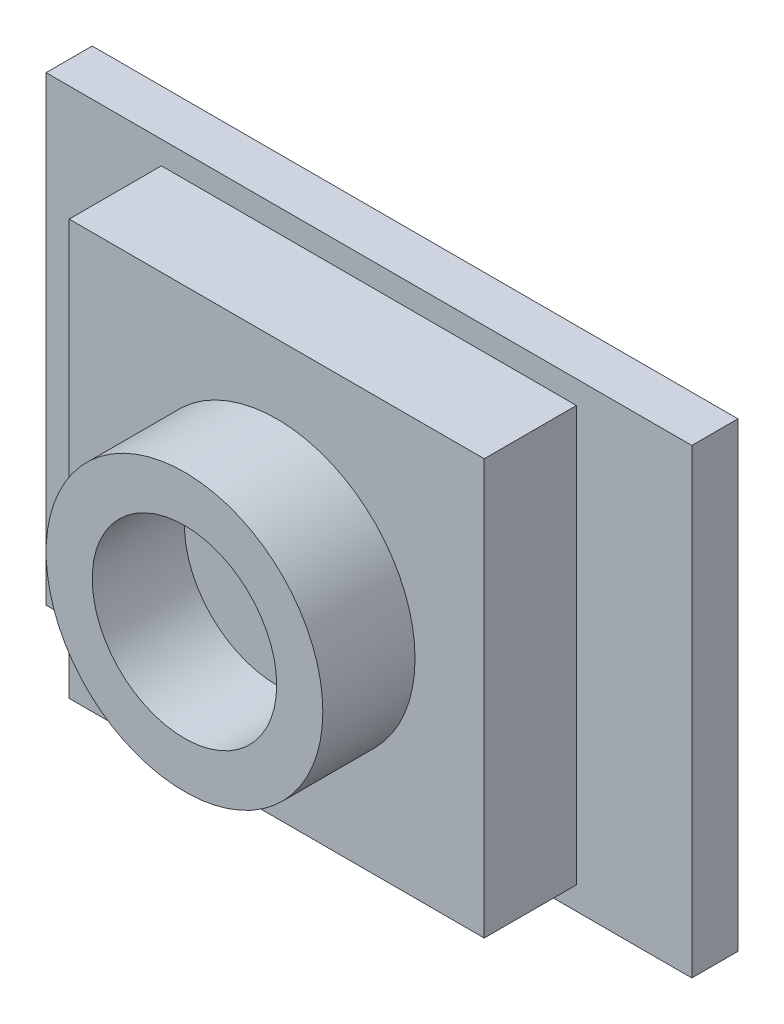
ISO-10303-21;
HEADER;
FILE_DESCRIPTION(('STEP AP214'),'2;1');
FILE_NAME('part.step','',(''),(''),'','','');
FILE_SCHEMA(('AUTOMOTIVE_DESIGN { 1 0 10303 214 1 1 1 1 }'));
ENDSEC;
DATA;
#1=APPLICATION_CONTEXT('core data for automotive mechanical design processes');
#2=APPLICATION_PROTOCOL_DEFINITION('international standard','automotive_design',2000,#1);
#3=PRODUCT_CONTEXT('',#1,'mechanical');
#4=PRODUCT('Part','Part','',(#3));
#5=PRODUCT_RELATED_PRODUCT_CATEGORY('part','',(#4));
#6=PRODUCT_DEFINITION_FORMATION('','',#4);
#7=PRODUCT_DEFINITION_CONTEXT('part definition',#1,'design');
#8=PRODUCT_DEFINITION('design','',#6,#7);
#9=PRODUCT_DEFINITION_SHAPE('','',#8);
#10=(LENGTH_UNIT() NAMED_UNIT(*) SI_UNIT(.MILLI.,.METRE.));
#11=(NAMED_UNIT(*) PLANE_ANGLE_UNIT() SI_UNIT($,.RADIAN.));
#12=(NAMED_UNIT(*) SI_UNIT($,.STERADIAN.) SOLID_ANGLE_UNIT());
#13=UNCERTAINTY_MEASURE_WITH_UNIT(LENGTH_MEASURE(1.E-05),#10,'distance_accuracy_value','');
#14=(GEOMETRIC_REPRESENTATION_CONTEXT(3) GLOBAL_UNCERTAINTY_ASSIGNED_CONTEXT((#13)) GLOBAL_UNIT_ASSIGNED_CONTEXT((#10,
#11,#12)) REPRESENTATION_CONTEXT('',''));
#15=CARTESIAN_POINT('',(0.,0.,0.));
#16=DIRECTION('',(0.,0.,1.));
#17=DIRECTION('',(1.,0.,0.));
#18=AXIS2_PLACEMENT_3D('',#15,#16,#17);
#19=CARTESIAN_POINT('',(0.,0.,0.));
#20=DIRECTION('',(0.,0.,1.));
#21=DIRECTION('',(1.,0.,0.));
#22=AXIS2_PLACEMENT_3D('',#19,#20,#21);
#23=PLANE('',#22);
#24=DIRECTION('',(1.,0.,0.));
#25=VECTOR('',#24,1.);
#26=CARTESIAN_POINT('',(-44.45,-31.75,0.));
#27=LINE('',#26,#25);
#28=CARTESIAN_POINT('',(-44.45,-31.75,0.));
#29=VERTEX_POINT('',#28);
#30=CARTESIAN_POINT('',(44.45,-31.75,0.));
#31=VERTEX_POINT('',#30);
#32=EDGE_CURVE('E131',#29,#31,#27,.T.);
#33=ORIENTED_EDGE('',*,*,#32,.T.);
#34=DIRECTION('',(0.,1.,0.));
#35=VECTOR('',#34,1.);
#36=CARTESIAN_POINT('',(44.45,-31.75,0.));
#37=LINE('',#36,#35);
#38=CARTESIAN_POINT('',(44.45,31.75,0.));
#39=VERTEX_POINT('',#38);
#40=EDGE_CURVE('E134',#31,#39,#37,.T.);
#41=ORIENTED_EDGE('',*,*,#40,.T.);
#42=DIRECTION('',(-1.,0.,0.));
#43=VECTOR('',#42,1.);
#44=CARTESIAN_POINT('',(-44.45,31.75,0.));
#45=LINE('',#44,#43);
#46=CARTESIAN_POINT('',(-44.45,31.75,0.));
#47=VERTEX_POINT('',#46);
#48=EDGE_CURVE('E151',#39,#47,#45,.T.);
#49=ORIENTED_EDGE('',*,*,#48,.T.);
#50=DIRECTION('',(0.,-1.,0.));
#51=VECTOR('',#50,1.);
#52=CARTESIAN_POINT('',(-44.45,-31.75,0.));
#53=LINE('',#52,#51);
#54=EDGE_CURVE('E142',#47,#29,#53,.T.);
#55=ORIENTED_EDGE('',*,*,#54,.T.);
#56=EDGE_LOOP('',(#33,#41,#49,#55));
#57=FACE_BOUND('',#56,.T.);
#58=DIRECTION('',(0.,1.,0.));
#59=VECTOR('',#58,1.);
#60=CARTESIAN_POINT('',(28.575,-28.575,0.));
#61=LINE('',#60,#59);
#62=CARTESIAN_POINT('',(28.575,-28.575,0.));
#63=VERTEX_POINT('',#62);
#64=CARTESIAN_POINT('',(28.575,28.575,0.));
#65=VERTEX_POINT('',#64);
#66=EDGE_CURVE('E306',#63,#65,#61,.T.);
#67=ORIENTED_EDGE('',*,*,#66,.F.);
#68=DIRECTION('',(1.,0.,0.));
#69=VECTOR('',#68,1.);
#70=CARTESIAN_POINT('',(-28.575,-28.575,0.));
#71=LINE('',#70,#69);
#72=CARTESIAN_POINT('',(-28.575,-28.575,0.));
#73=VERTEX_POINT('',#72);
#74=EDGE_CURVE('E129',#73,#63,#71,.T.);
#75=ORIENTED_EDGE('',*,*,#74,.F.);
#76=DIRECTION('',(0.,-1.,0.));
#77=VECTOR('',#76,1.);
#78=CARTESIAN_POINT('',(-28.575,-28.575,0.));
#79=LINE('',#78,#77);
#80=CARTESIAN_POINT('',(-28.575,28.575,0.));
#81=VERTEX_POINT('',#80);
#82=EDGE_CURVE('E125',#81,#73,#79,.T.);
#83=ORIENTED_EDGE('',*,*,#82,.F.);
#84=DIRECTION('',(-1.,0.,0.));
#85=VECTOR('',#84,1.);
#86=CARTESIAN_POINT('',(-28.575,28.575,0.));
#87=LINE('',#86,#85);
#88=EDGE_CURVE('E308',#65,#81,#87,.T.);
#89=ORIENTED_EDGE('',*,*,#88,.F.);
#90=EDGE_LOOP('',(#67,#75,#83,#89));
#91=FACE_BOUND('',#90,.T.);
#92=ADVANCED_FACE('F33',(#57,#91),#23,.T.);
#93=CARTESIAN_POINT('',(-44.45,-31.75,-6.35));
#94=DIRECTION('',(0.,-1.,0.));
#95=DIRECTION('',(0.,0.,-1.));
#96=AXIS2_PLACEMENT_3D('',#93,#94,#95);
#97=PLANE('',#96);
#98=ORIENTED_EDGE('',*,*,#32,.F.);
#99=DIRECTION('',(0.,0.,1.));
#100=VECTOR('',#99,1.);
#101=CARTESIAN_POINT('',(-44.45,-31.75,-6.35));
#102=LINE('',#101,#100);
#103=CARTESIAN_POINT('',(-44.45,-31.75,-6.35));
#104=VERTEX_POINT('',#103);
#105=EDGE_CURVE('E41',#104,#29,#102,.T.);
#106=ORIENTED_EDGE('',*,*,#105,.F.);
#107=DIRECTION('',(1.,0.,0.));
#108=VECTOR('',#107,1.);
#109=CARTESIAN_POINT('',(-44.45,-31.75,-6.35));
#110=LINE('',#109,#108);
#111=CARTESIAN_POINT('',(44.45,-31.75,-6.35));
#112=VERTEX_POINT('',#111);
#113=EDGE_CURVE('E139',#104,#112,#110,.T.);
#114=ORIENTED_EDGE('',*,*,#113,.T.);
#115=DIRECTION('',(0.,0.,1.));
#116=VECTOR('',#115,1.);
#117=CARTESIAN_POINT('',(44.45,-31.75,-6.35));
#118=LINE('',#117,#116);
#119=EDGE_CURVE('E82',#112,#31,#118,.T.);
#120=ORIENTED_EDGE('',*,*,#119,.T.);
#121=EDGE_LOOP('',(#98,#106,#114,#120));
#122=FACE_BOUND('',#121,.T.);
#123=ADVANCED_FACE('F35',(#122),#97,.T.);
#124=CARTESIAN_POINT('',(-44.45,-31.75,-6.35));
#125=DIRECTION('',(-1.,0.,0.));
#126=DIRECTION('',(0.,0.,1.));
#127=AXIS2_PLACEMENT_3D('',#124,#125,#126);
#128=PLANE('',#127);
#129=ORIENTED_EDGE('',*,*,#54,.F.);
#130=DIRECTION('',(0.,0.,1.));
#131=VECTOR('',#130,1.);
#132=CARTESIAN_POINT('',(-44.45,31.75,-6.35));
#133=LINE('',#132,#131);
#134=CARTESIAN_POINT('',(-44.45,31.75,-6.35));
#135=VERTEX_POINT('',#134);
#136=EDGE_CURVE('E157',#135,#47,#133,.T.);
#137=ORIENTED_EDGE('',*,*,#136,.F.);
#138=DIRECTION('',(0.,-1.,0.));
#139=VECTOR('',#138,1.);
#140=CARTESIAN_POINT('',(-44.45,-31.75,-6.35));
#141=LINE('',#140,#139);
#142=EDGE_CURVE('E147',#135,#104,#141,.T.);
#143=ORIENTED_EDGE('',*,*,#142,.T.);
#144=ORIENTED_EDGE('',*,*,#105,.T.);
#145=EDGE_LOOP('',(#129,#137,#143,#144));
#146=FACE_BOUND('',#145,.T.);
#147=ADVANCED_FACE('F164',(#146),#128,.T.);
#148=CARTESIAN_POINT('',(-44.45,31.75,-6.35));
#149=DIRECTION('',(0.,1.,0.));
#150=DIRECTION('',(0.,0.,1.));
#151=AXIS2_PLACEMENT_3D('',#148,#149,#150);
#152=PLANE('',#151);
#153=ORIENTED_EDGE('',*,*,#48,.F.);
#154=DIRECTION('',(0.,0.,1.));
#155=VECTOR('',#154,1.);
#156=CARTESIAN_POINT('',(44.45,31.75,-6.35));
#157=LINE('',#156,#155);
#158=CARTESIAN_POINT('',(44.45,31.75,-6.35));
#159=VERTEX_POINT('',#158);
#160=EDGE_CURVE('E159',#159,#39,#157,.T.);
#161=ORIENTED_EDGE('',*,*,#160,.F.);
#162=DIRECTION('',(-1.,0.,0.));
#163=VECTOR('',#162,1.);
#164=CARTESIAN_POINT('',(-44.45,31.75,-6.35));
#165=LINE('',#164,#163);
#166=EDGE_CURVE('E144',#159,#135,#165,.T.);
#167=ORIENTED_EDGE('',*,*,#166,.T.);
#168=ORIENTED_EDGE('',*,*,#136,.T.);
#169=EDGE_LOOP('',(#153,#161,#167,#168));
#170=FACE_BOUND('',#169,.T.);
#171=ADVANCED_FACE('F168',(#170),#152,.T.);
#172=CARTESIAN_POINT('',(44.45,-31.75,-6.35));
#173=DIRECTION('',(1.,0.,0.));
#174=DIRECTION('',(0.,0.,-1.));
#175=AXIS2_PLACEMENT_3D('',#172,#173,#174);
#176=PLANE('',#175);
#177=ORIENTED_EDGE('',*,*,#40,.F.);
#178=ORIENTED_EDGE('',*,*,#119,.F.);
#179=DIRECTION('',(0.,1.,0.));
#180=VECTOR('',#179,1.);
#181=CARTESIAN_POINT('',(44.45,-31.75,-6.35));
#182=LINE('',#181,#180);
#183=EDGE_CURVE('E141',#112,#159,#182,.T.);
#184=ORIENTED_EDGE('',*,*,#183,.T.);
#185=ORIENTED_EDGE('',*,*,#160,.T.);
#186=EDGE_LOOP('',(#177,#178,#184,#185));
#187=FACE_BOUND('',#186,.T.);
#188=ADVANCED_FACE('F160',(#187),#176,.T.);
#189=CARTESIAN_POINT('',(0.,0.,-6.35));
#190=DIRECTION('',(0.,0.,1.));
#191=DIRECTION('',(1.,0.,0.));
#192=AXIS2_PLACEMENT_3D('',#189,#190,#191);
#193=PLANE('',#192);
#194=ORIENTED_EDGE('',*,*,#113,.F.);
#195=ORIENTED_EDGE('',*,*,#142,.F.);
#196=ORIENTED_EDGE('',*,*,#166,.F.);
#197=ORIENTED_EDGE('',*,*,#183,.F.);
#198=EDGE_LOOP('',(#194,#195,#196,#197));
#199=FACE_BOUND('',#198,.T.);
#200=ADVANCED_FACE('F170',(#199),#193,.F.);
#201=CARTESIAN_POINT('',(-28.575,-28.575,12.7));
#202=DIRECTION('',(0.,1.,0.));
#203=DIRECTION('',(0.,0.,1.));
#204=AXIS2_PLACEMENT_3D('',#201,#202,#203);
#205=PLANE('',#204);
#206=ORIENTED_EDGE('',*,*,#74,.T.);
#207=DIRECTION('',(0.,0.,-1.));
#208=VECTOR('',#207,1.);
#209=CARTESIAN_POINT('',(28.575,-28.575,12.7));
#210=LINE('',#209,#208);
#211=CARTESIAN_POINT('',(28.575,-28.575,12.7));
#212=VERTEX_POINT('',#211);
#213=EDGE_CURVE('E110',#212,#63,#210,.T.);
#214=ORIENTED_EDGE('',*,*,#213,.F.);
#215=DIRECTION('',(1.,0.,0.));
#216=VECTOR('',#215,1.);
#217=CARTESIAN_POINT('',(-28.575,-28.575,12.7));
#218=LINE('',#217,#216);
#219=CARTESIAN_POINT('',(-28.575,-28.575,12.7));
#220=VERTEX_POINT('',#219);
#221=EDGE_CURVE('E117',#220,#212,#218,.T.);
#222=ORIENTED_EDGE('',*,*,#221,.F.);
#223=DIRECTION('',(0.,0.,-1.));
#224=VECTOR('',#223,1.);
#225=CARTESIAN_POINT('',(-28.575,-28.575,12.7));
#226=LINE('',#225,#224);
#227=EDGE_CURVE('E304',#220,#73,#226,.T.);
#228=ORIENTED_EDGE('',*,*,#227,.T.);
#229=EDGE_LOOP('',(#206,#214,#222,#228));
#230=FACE_BOUND('',#229,.T.);
#231=ADVANCED_FACE('F127',(#230),#205,.F.);
#232=CARTESIAN_POINT('',(28.575,-28.575,12.7));
#233=DIRECTION('',(-1.,0.,0.));
#234=DIRECTION('',(0.,0.,1.));
#235=AXIS2_PLACEMENT_3D('',#232,#233,#234);
#236=PLANE('',#235);
#237=ORIENTED_EDGE('',*,*,#66,.T.);
#238=DIRECTION('',(0.,0.,-1.));
#239=VECTOR('',#238,1.);
#240=CARTESIAN_POINT('',(28.575,28.575,12.7));
#241=LINE('',#240,#239);
#242=CARTESIAN_POINT('',(28.575,28.575,12.7));
#243=VERTEX_POINT('',#242);
#244=EDGE_CURVE('E113',#243,#65,#241,.T.);
#245=ORIENTED_EDGE('',*,*,#244,.F.);
#246=DIRECTION('',(0.,1.,0.));
#247=VECTOR('',#246,1.);
#248=CARTESIAN_POINT('',(28.575,-28.575,12.7));
#249=LINE('',#248,#247);
#250=EDGE_CURVE('E106',#212,#243,#249,.T.);
#251=ORIENTED_EDGE('',*,*,#250,.F.);
#252=ORIENTED_EDGE('',*,*,#213,.T.);
#253=EDGE_LOOP('',(#237,#245,#251,#252));
#254=FACE_BOUND('',#253,.T.);
#255=ADVANCED_FACE('F108',(#254),#236,.F.);
#256=CARTESIAN_POINT('',(-28.575,28.575,12.7));
#257=DIRECTION('',(0.,-1.,0.));
#258=DIRECTION('',(0.,0.,-1.));
#259=AXIS2_PLACEMENT_3D('',#256,#257,#258);
#260=PLANE('',#259);
#261=ORIENTED_EDGE('',*,*,#88,.T.);
#262=DIRECTION('',(0.,0.,-1.));
#263=VECTOR('',#262,1.);
#264=CARTESIAN_POINT('',(-28.575,28.575,12.7));
#265=LINE('',#264,#263);
#266=CARTESIAN_POINT('',(-28.575,28.575,12.7));
#267=VERTEX_POINT('',#266);
#268=EDGE_CURVE('E48',#267,#81,#265,.T.);
#269=ORIENTED_EDGE('',*,*,#268,.F.);
#270=DIRECTION('',(-1.,0.,0.));
#271=VECTOR('',#270,1.);
#272=CARTESIAN_POINT('',(-28.575,28.575,12.7));
#273=LINE('',#272,#271);
#274=EDGE_CURVE('E116',#243,#267,#273,.T.);
#275=ORIENTED_EDGE('',*,*,#274,.F.);
#276=ORIENTED_EDGE('',*,*,#244,.T.);
#277=EDGE_LOOP('',(#261,#269,#275,#276));
#278=FACE_BOUND('',#277,.T.);
#279=ADVANCED_FACE('F218',(#278),#260,.F.);
#280=CARTESIAN_POINT('',(-28.575,-28.575,12.7));
#281=DIRECTION('',(1.,0.,0.));
#282=DIRECTION('',(0.,0.,-1.));
#283=AXIS2_PLACEMENT_3D('',#280,#281,#282);
#284=PLANE('',#283);
#285=ORIENTED_EDGE('',*,*,#82,.T.);
#286=ORIENTED_EDGE('',*,*,#227,.F.);
#287=DIRECTION('',(0.,-1.,0.));
#288=VECTOR('',#287,1.);
#289=CARTESIAN_POINT('',(-28.575,-28.575,12.7));
#290=LINE('',#289,#288);
#291=EDGE_CURVE('E121',#267,#220,#290,.T.);
#292=ORIENTED_EDGE('',*,*,#291,.F.);
#293=ORIENTED_EDGE('',*,*,#268,.T.);
#294=EDGE_LOOP('',(#285,#286,#292,#293));
#295=FACE_BOUND('',#294,.T.);
#296=ADVANCED_FACE('F227',(#295),#284,.F.);
#297=CARTESIAN_POINT('',(0.,0.,12.7));
#298=DIRECTION('',(0.,0.,1.));
#299=DIRECTION('',(1.,0.,0.));
#300=AXIS2_PLACEMENT_3D('',#297,#298,#299);
#301=PLANE('',#300);
#302=CARTESIAN_POINT('',(0.,0.,12.7));
#303=DIRECTION('',(0.,0.,1.));
#304=DIRECTION('',(1.,0.,0.));
#305=AXIS2_PLACEMENT_3D('',#302,#303,#304);
#306=CIRCLE('',#305,19.05);
#307=CARTESIAN_POINT('',(19.05,0.,12.7));
#308=VERTEX_POINT('',#307);
#309=EDGE_CURVE('E294',#308,#308,#306,.T.);
#310=ORIENTED_EDGE('',*,*,#309,.F.);
#311=EDGE_LOOP('',(#310));
#312=FACE_BOUND('',#311,.T.);
#313=ORIENTED_EDGE('',*,*,#221,.T.);
#314=ORIENTED_EDGE('',*,*,#250,.T.);
#315=ORIENTED_EDGE('',*,*,#274,.T.);
#316=ORIENTED_EDGE('',*,*,#291,.T.);
#317=EDGE_LOOP('',(#313,#314,#315,#316));
#318=FACE_BOUND('',#317,.T.);
#319=ADVANCED_FACE('F120',(#312,#318),#301,.T.);
#320=CARTESIAN_POINT('',(0.,0.,25.4));
#321=DIRECTION('',(0.,0.,1.));
#322=DIRECTION('',(1.,0.,0.));
#323=AXIS2_PLACEMENT_3D('',#320,#321,#322);
#324=PLANE('',#323);
#325=CARTESIAN_POINT('',(0.,0.,25.4));
#326=DIRECTION('',(0.,0.,1.));
#327=DIRECTION('',(1.,0.,0.));
#328=AXIS2_PLACEMENT_3D('',#325,#326,#327);
#329=CIRCLE('',#328,19.05);
#330=CARTESIAN_POINT('',(19.05,0.,25.4));
#331=VERTEX_POINT('',#330);
#332=EDGE_CURVE('E297',#331,#331,#329,.T.);
#333=ORIENTED_EDGE('',*,*,#332,.T.);
#334=EDGE_LOOP('',(#333));
#335=FACE_BOUND('',#334,.T.);
#336=CARTESIAN_POINT('',(0.,0.,25.4));
#337=DIRECTION('',(0.,0.,1.));
#338=DIRECTION('',(1.,0.,0.));
#339=AXIS2_PLACEMENT_3D('',#336,#337,#338);
#340=CIRCLE('',#339,12.7);
#341=CARTESIAN_POINT('',(12.7,0.,25.4));
#342=VERTEX_POINT('',#341);
#343=EDGE_CURVE('E292',#342,#342,#340,.T.);
#344=ORIENTED_EDGE('',*,*,#343,.F.);
#345=EDGE_LOOP('',(#344));
#346=FACE_BOUND('',#345,.T.);
#347=ADVANCED_FACE('F245',(#335,#346),#324,.T.);
#348=CARTESIAN_POINT('',(0.,0.,25.4));
#349=DIRECTION('',(0.,0.,-1.));
#350=DIRECTION('',(-1.,0.,0.));
#351=AXIS2_PLACEMENT_3D('',#348,#349,#350);
#352=CYLINDRICAL_SURFACE('',#351,19.05);
#353=ORIENTED_EDGE('',*,*,#332,.F.);
#354=EDGE_LOOP('',(#353));
#355=FACE_BOUND('',#354,.T.);
#356=ORIENTED_EDGE('',*,*,#309,.T.);
#357=EDGE_LOOP('',(#356));
#358=FACE_BOUND('',#357,.T.);
#359=ADVANCED_FACE('F257',(#355,#358),#352,.T.);
#360=CARTESIAN_POINT('',(0.,0.,25.4));
#361=DIRECTION('',(0.,0.,-1.));
#362=DIRECTION('',(-1.,0.,0.));
#363=AXIS2_PLACEMENT_3D('',#360,#361,#362);
#364=CYLINDRICAL_SURFACE('',#363,12.7);
#365=ORIENTED_EDGE('',*,*,#343,.T.);
#366=EDGE_LOOP('',(#365));
#367=FACE_BOUND('',#366,.T.);
#368=CARTESIAN_POINT('',(0.,0.,12.7));
#369=DIRECTION('',(0.,0.,1.));
#370=DIRECTION('',(1.,0.,0.));
#371=AXIS2_PLACEMENT_3D('',#368,#369,#370);
#372=CIRCLE('',#371,12.7);
#373=CARTESIAN_POINT('',(12.7,0.,12.7));
#374=VERTEX_POINT('',#373);
#375=EDGE_CURVE('E11',#374,#374,#372,.F.);
#376=ORIENTED_EDGE('',*,*,#375,.T.);
#377=EDGE_LOOP('',(#376));
#378=FACE_BOUND('',#377,.T.);
#379=ADVANCED_FACE('F267',(#367,#378),#364,.F.);
#380=ORIENTED_EDGE('',*,*,#375,.F.);
#381=EDGE_LOOP('',(#380));
#382=FACE_BOUND('',#381,.T.);
#383=ADVANCED_FACE('F248',(#382),#301,.T.);
#384=CLOSED_SHELL('',(#92,#123,#147,#171,#188,#200,#231,#255,#279,#296,#319,#347,#359,#379,#383));
#385=MANIFOLD_SOLID_BREP('B2',#384);
#386=ADVANCED_BREP_SHAPE_REPRESENTATION('',(#18,#385),#14);
#387=SHAPE_DEFINITION_REPRESENTATION(#9,#386);
ENDSEC;
END-ISO-10303-21;
